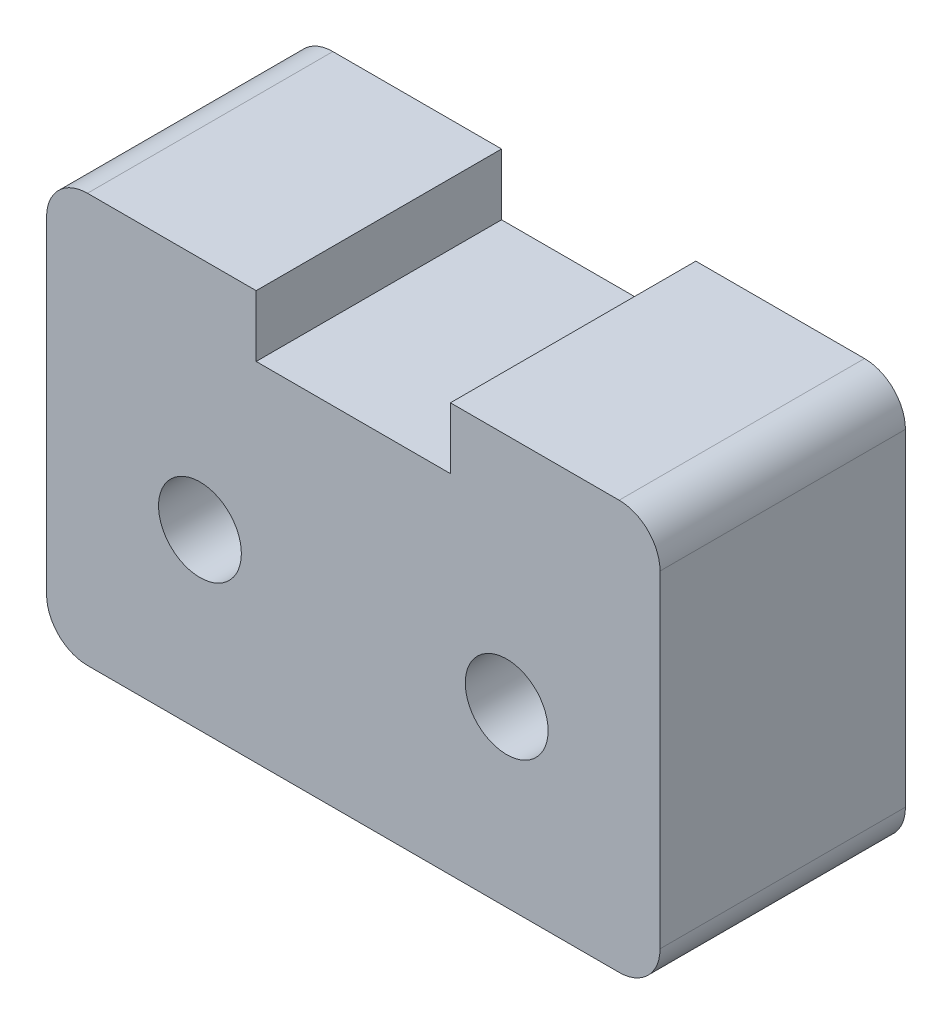
ISO-10303-21;
HEADER;
FILE_DESCRIPTION(('STEP AP214'),'2;1');
FILE_NAME('part.step','',(''),(''),'','','');
FILE_SCHEMA(('AUTOMOTIVE_DESIGN { 1 0 10303 214 1 1 1 1 }'));
ENDSEC;
DATA;
#1=APPLICATION_CONTEXT('core data for automotive mechanical design processes');
#2=APPLICATION_PROTOCOL_DEFINITION('international standard','automotive_design',2000,#1);
#3=PRODUCT_CONTEXT('',#1,'mechanical');
#4=PRODUCT('Part','Part','',(#3));
#5=PRODUCT_RELATED_PRODUCT_CATEGORY('part','',(#4));
#6=PRODUCT_DEFINITION_FORMATION('','',#4);
#7=PRODUCT_DEFINITION_CONTEXT('part definition',#1,'design');
#8=PRODUCT_DEFINITION('design','',#6,#7);
#9=PRODUCT_DEFINITION_SHAPE('','',#8);
#10=(LENGTH_UNIT() NAMED_UNIT(*) SI_UNIT(.MILLI.,.METRE.));
#11=(NAMED_UNIT(*) PLANE_ANGLE_UNIT() SI_UNIT($,.RADIAN.));
#12=(NAMED_UNIT(*) SI_UNIT($,.STERADIAN.) SOLID_ANGLE_UNIT());
#13=UNCERTAINTY_MEASURE_WITH_UNIT(LENGTH_MEASURE(1.E-05),#10,'distance_accuracy_value','');
#14=(GEOMETRIC_REPRESENTATION_CONTEXT(3) GLOBAL_UNCERTAINTY_ASSIGNED_CONTEXT((#13)) GLOBAL_UNIT_ASSIGNED_CONTEXT((#10,
#11,#12)) REPRESENTATION_CONTEXT('',''));
#15=CARTESIAN_POINT('',(0.,0.,0.));
#16=DIRECTION('',(0.,0.,1.));
#17=DIRECTION('',(1.,0.,0.));
#18=AXIS2_PLACEMENT_3D('',#15,#16,#17);
#19=CARTESIAN_POINT('',(-4.75,0.,12.));
#20=DIRECTION('',(-1.,0.,0.));
#21=DIRECTION('',(0.,0.,1.));
#22=AXIS2_PLACEMENT_3D('',#19,#20,#21);
#23=PLANE('',#22);
#24=DIRECTION('',(0.,1.,0.));
#25=VECTOR('',#24,1.);
#26=CARTESIAN_POINT('',(-4.75,0.,0.));
#27=LINE('',#26,#25);
#28=CARTESIAN_POINT('',(-4.75,0.,0.));
#29=VERTEX_POINT('',#28);
#30=CARTESIAN_POINT('',(-4.75,3.,0.));
#31=VERTEX_POINT('',#30);
#32=EDGE_CURVE('E150',#29,#31,#27,.T.);
#33=ORIENTED_EDGE('',*,*,#32,.T.);
#34=DIRECTION('',(0.,0.,-1.));
#35=VECTOR('',#34,1.);
#36=CARTESIAN_POINT('',(-4.75,3.,12.));
#37=LINE('',#36,#35);
#38=CARTESIAN_POINT('',(-4.75,3.,12.));
#39=VERTEX_POINT('',#38);
#40=EDGE_CURVE('E132',#39,#31,#37,.T.);
#41=ORIENTED_EDGE('',*,*,#40,.F.);
#42=DIRECTION('',(0.,1.,0.));
#43=VECTOR('',#42,1.);
#44=CARTESIAN_POINT('',(-4.75,0.,12.));
#45=LINE('',#44,#43);
#46=CARTESIAN_POINT('',(-4.75,0.,12.));
#47=VERTEX_POINT('',#46);
#48=EDGE_CURVE('E137',#47,#39,#45,.T.);
#49=ORIENTED_EDGE('',*,*,#48,.F.);
#50=DIRECTION('',(0.,0.,-1.));
#51=VECTOR('',#50,1.);
#52=CARTESIAN_POINT('',(-4.75,0.,12.));
#53=LINE('',#52,#51);
#54=EDGE_CURVE('E210',#47,#29,#53,.T.);
#55=ORIENTED_EDGE('',*,*,#54,.T.);
#56=EDGE_LOOP('',(#33,#41,#49,#55));
#57=FACE_BOUND('',#56,.T.);
#58=ADVANCED_FACE('F36',(#57),#23,.F.);
#59=CARTESIAN_POINT('',(-4.75,3.,12.));
#60=DIRECTION('',(0.,-1.,0.));
#61=DIRECTION('',(1.,0.,0.));
#62=AXIS2_PLACEMENT_3D('',#59,#60,#61);
#63=PLANE('',#62);
#64=DIRECTION('',(-1.,0.,0.));
#65=VECTOR('',#64,1.);
#66=CARTESIAN_POINT('',(-4.75,3.,0.));
#67=LINE('',#66,#65);
#68=CARTESIAN_POINT('',(-13.,3.,0.));
#69=VERTEX_POINT('',#68);
#70=EDGE_CURVE('E217',#31,#69,#67,.T.);
#71=ORIENTED_EDGE('',*,*,#70,.T.);
#72=DIRECTION('',(0.,0.,-1.));
#73=VECTOR('',#72,1.);
#74=CARTESIAN_POINT('',(-13.,3.,12.));
#75=LINE('',#74,#73);
#76=CARTESIAN_POINT('',(-13.,3.,12.));
#77=VERTEX_POINT('',#76);
#78=EDGE_CURVE('E11',#69,#77,#75,.F.);
#79=ORIENTED_EDGE('',*,*,#78,.T.);
#80=DIRECTION('',(-1.,0.,0.));
#81=VECTOR('',#80,1.);
#82=CARTESIAN_POINT('',(-4.75,3.,12.));
#83=LINE('',#82,#81);
#84=EDGE_CURVE('E127',#39,#77,#83,.T.);
#85=ORIENTED_EDGE('',*,*,#84,.F.);
#86=ORIENTED_EDGE('',*,*,#40,.T.);
#87=EDGE_LOOP('',(#71,#79,#85,#86));
#88=FACE_BOUND('',#87,.T.);
#89=ADVANCED_FACE('F130',(#88),#63,.F.);
#90=CARTESIAN_POINT('',(-15.,3.,12.));
#91=DIRECTION('',(1.,0.,0.));
#92=DIRECTION('',(0.,0.,-1.));
#93=AXIS2_PLACEMENT_3D('',#90,#91,#92);
#94=PLANE('',#93);
#95=DIRECTION('',(0.,-1.,0.));
#96=VECTOR('',#95,1.);
#97=CARTESIAN_POINT('',(-15.,3.,0.));
#98=LINE('',#97,#96);
#99=CARTESIAN_POINT('',(-15.,0.999999999999998,0.));
#100=VERTEX_POINT('',#99);
#101=CARTESIAN_POINT('',(-15.,-15.,0.));
#102=VERTEX_POINT('',#101);
#103=EDGE_CURVE('E220',#100,#102,#98,.T.);
#104=ORIENTED_EDGE('',*,*,#103,.T.);
#105=DIRECTION('',(0.,0.,-1.));
#106=VECTOR('',#105,1.);
#107=CARTESIAN_POINT('',(-15.,-15.,12.));
#108=LINE('',#107,#106);
#109=CARTESIAN_POINT('',(-15.,-15.,12.));
#110=VERTEX_POINT('',#109);
#111=EDGE_CURVE('E59',#102,#110,#108,.F.);
#112=ORIENTED_EDGE('',*,*,#111,.T.);
#113=DIRECTION('',(0.,-1.,0.));
#114=VECTOR('',#113,1.);
#115=CARTESIAN_POINT('',(-15.,3.,12.));
#116=LINE('',#115,#114);
#117=CARTESIAN_POINT('',(-15.,0.999999999999998,12.));
#118=VERTEX_POINT('',#117);
#119=EDGE_CURVE('E136',#118,#110,#116,.T.);
#120=ORIENTED_EDGE('',*,*,#119,.F.);
#121=DIRECTION('',(0.,0.,-1.));
#122=VECTOR('',#121,1.);
#123=CARTESIAN_POINT('',(-15.,0.999999999999998,12.));
#124=LINE('',#123,#122);
#125=EDGE_CURVE('E183',#118,#100,#124,.T.);
#126=ORIENTED_EDGE('',*,*,#125,.T.);
#127=EDGE_LOOP('',(#104,#112,#120,#126));
#128=FACE_BOUND('',#127,.T.);
#129=ADVANCED_FACE('F264',(#128),#94,.F.);
#130=CARTESIAN_POINT('',(-15.,-17.,12.));
#131=DIRECTION('',(0.,1.,0.));
#132=DIRECTION('',(0.,0.,1.));
#133=AXIS2_PLACEMENT_3D('',#130,#131,#132);
#134=PLANE('',#133);
#135=DIRECTION('',(1.,0.,0.));
#136=VECTOR('',#135,1.);
#137=CARTESIAN_POINT('',(-15.,-17.,0.));
#138=LINE('',#137,#136);
#139=CARTESIAN_POINT('',(-13.,-17.,0.));
#140=VERTEX_POINT('',#139);
#141=CARTESIAN_POINT('',(13.,-17.,0.));
#142=VERTEX_POINT('',#141);
#143=EDGE_CURVE('E205',#140,#142,#138,.T.);
#144=ORIENTED_EDGE('',*,*,#143,.T.);
#145=DIRECTION('',(0.,0.,-1.));
#146=VECTOR('',#145,1.);
#147=CARTESIAN_POINT('',(13.,-17.,12.));
#148=LINE('',#147,#146);
#149=CARTESIAN_POINT('',(13.,-17.,12.));
#150=VERTEX_POINT('',#149);
#151=EDGE_CURVE('E174',#142,#150,#148,.F.);
#152=ORIENTED_EDGE('',*,*,#151,.T.);
#153=DIRECTION('',(1.,0.,0.));
#154=VECTOR('',#153,1.);
#155=CARTESIAN_POINT('',(-15.,-17.,12.));
#156=LINE('',#155,#154);
#157=CARTESIAN_POINT('',(-13.,-17.,12.));
#158=VERTEX_POINT('',#157);
#159=EDGE_CURVE('E241',#158,#150,#156,.T.);
#160=ORIENTED_EDGE('',*,*,#159,.F.);
#161=DIRECTION('',(0.,0.,-1.));
#162=VECTOR('',#161,1.);
#163=CARTESIAN_POINT('',(-13.,-17.,12.));
#164=LINE('',#163,#162);
#165=EDGE_CURVE('E171',#158,#140,#164,.T.);
#166=ORIENTED_EDGE('',*,*,#165,.T.);
#167=EDGE_LOOP('',(#144,#152,#160,#166));
#168=FACE_BOUND('',#167,.T.);
#169=ADVANCED_FACE('F232',(#168),#134,.F.);
#170=CARTESIAN_POINT('',(15.,3.,12.));
#171=DIRECTION('',(-1.,0.,0.));
#172=DIRECTION('',(0.,0.,1.));
#173=AXIS2_PLACEMENT_3D('',#170,#171,#172);
#174=PLANE('',#173);
#175=DIRECTION('',(0.,1.,0.));
#176=VECTOR('',#175,1.);
#177=CARTESIAN_POINT('',(15.,3.,12.));
#178=LINE('',#177,#176);
#179=CARTESIAN_POINT('',(15.,-15.,12.));
#180=VERTEX_POINT('',#179);
#181=CARTESIAN_POINT('',(15.,0.999999999999998,12.));
#182=VERTEX_POINT('',#181);
#183=EDGE_CURVE('E240',#180,#182,#178,.T.);
#184=ORIENTED_EDGE('',*,*,#183,.F.);
#185=DIRECTION('',(0.,0.,-1.));
#186=VECTOR('',#185,1.);
#187=CARTESIAN_POINT('',(15.,-15.,12.));
#188=LINE('',#187,#186);
#189=CARTESIAN_POINT('',(15.,-15.,0.));
#190=VERTEX_POINT('',#189);
#191=EDGE_CURVE('E154',#180,#190,#188,.T.);
#192=ORIENTED_EDGE('',*,*,#191,.T.);
#193=DIRECTION('',(0.,1.,0.));
#194=VECTOR('',#193,1.);
#195=CARTESIAN_POINT('',(15.,3.,0.));
#196=LINE('',#195,#194);
#197=CARTESIAN_POINT('',(15.,0.999999999999998,0.));
#198=VERTEX_POINT('',#197);
#199=EDGE_CURVE('E202',#190,#198,#196,.T.);
#200=ORIENTED_EDGE('',*,*,#199,.T.);
#201=DIRECTION('',(0.,0.,-1.));
#202=VECTOR('',#201,1.);
#203=CARTESIAN_POINT('',(15.,0.999999999999998,12.));
#204=LINE('',#203,#202);
#205=EDGE_CURVE('E151',#198,#182,#204,.F.);
#206=ORIENTED_EDGE('',*,*,#205,.T.);
#207=EDGE_LOOP('',(#184,#192,#200,#206));
#208=FACE_BOUND('',#207,.T.);
#209=ADVANCED_FACE('F243',(#208),#174,.F.);
#210=CARTESIAN_POINT('',(4.75,3.,12.));
#211=DIRECTION('',(0.,-1.,0.));
#212=DIRECTION('',(1.,0.,0.));
#213=AXIS2_PLACEMENT_3D('',#210,#211,#212);
#214=PLANE('',#213);
#215=DIRECTION('',(-1.,0.,0.));
#216=VECTOR('',#215,1.);
#217=CARTESIAN_POINT('',(4.75,3.,12.));
#218=LINE('',#217,#216);
#219=CARTESIAN_POINT('',(13.,3.,12.));
#220=VERTEX_POINT('',#219);
#221=CARTESIAN_POINT('',(4.75,3.,12.));
#222=VERTEX_POINT('',#221);
#223=EDGE_CURVE('E193',#220,#222,#218,.T.);
#224=ORIENTED_EDGE('',*,*,#223,.F.);
#225=DIRECTION('',(0.,0.,-1.));
#226=VECTOR('',#225,1.);
#227=CARTESIAN_POINT('',(13.,3.,12.));
#228=LINE('',#227,#226);
#229=CARTESIAN_POINT('',(13.,3.,0.));
#230=VERTEX_POINT('',#229);
#231=EDGE_CURVE('E44',#220,#230,#228,.T.);
#232=ORIENTED_EDGE('',*,*,#231,.T.);
#233=DIRECTION('',(-1.,0.,0.));
#234=VECTOR('',#233,1.);
#235=CARTESIAN_POINT('',(4.75,3.,0.));
#236=LINE('',#235,#234);
#237=CARTESIAN_POINT('',(4.75,3.,0.));
#238=VERTEX_POINT('',#237);
#239=EDGE_CURVE('E192',#230,#238,#236,.T.);
#240=ORIENTED_EDGE('',*,*,#239,.T.);
#241=DIRECTION('',(0.,0.,-1.));
#242=VECTOR('',#241,1.);
#243=CARTESIAN_POINT('',(4.75,3.,12.));
#244=LINE('',#243,#242);
#245=EDGE_CURVE('E152',#222,#238,#244,.T.);
#246=ORIENTED_EDGE('',*,*,#245,.F.);
#247=EDGE_LOOP('',(#224,#232,#240,#246));
#248=FACE_BOUND('',#247,.T.);
#249=ADVANCED_FACE('F190',(#248),#214,.F.);
#250=CARTESIAN_POINT('',(4.75,0.,12.));
#251=DIRECTION('',(1.,0.,0.));
#252=DIRECTION('',(0.,0.,-1.));
#253=AXIS2_PLACEMENT_3D('',#250,#251,#252);
#254=PLANE('',#253);
#255=DIRECTION('',(0.,-1.,0.));
#256=VECTOR('',#255,1.);
#257=CARTESIAN_POINT('',(4.75,0.,0.));
#258=LINE('',#257,#256);
#259=CARTESIAN_POINT('',(4.75,0.,0.));
#260=VERTEX_POINT('',#259);
#261=EDGE_CURVE('E201',#238,#260,#258,.T.);
#262=ORIENTED_EDGE('',*,*,#261,.T.);
#263=DIRECTION('',(0.,0.,-1.));
#264=VECTOR('',#263,1.);
#265=CARTESIAN_POINT('',(4.75,0.,12.));
#266=LINE('',#265,#264);
#267=CARTESIAN_POINT('',(4.75,0.,12.));
#268=VERTEX_POINT('',#267);
#269=EDGE_CURVE('E157',#268,#260,#266,.T.);
#270=ORIENTED_EDGE('',*,*,#269,.F.);
#271=DIRECTION('',(0.,-1.,0.));
#272=VECTOR('',#271,1.);
#273=CARTESIAN_POINT('',(4.75,0.,12.));
#274=LINE('',#273,#272);
#275=EDGE_CURVE('E246',#222,#268,#274,.T.);
#276=ORIENTED_EDGE('',*,*,#275,.F.);
#277=ORIENTED_EDGE('',*,*,#245,.T.);
#278=EDGE_LOOP('',(#262,#270,#276,#277));
#279=FACE_BOUND('',#278,.T.);
#280=ADVANCED_FACE('F250',(#279),#254,.F.);
#281=CARTESIAN_POINT('',(4.75,0.,12.));
#282=DIRECTION('',(0.,-1.,0.));
#283=DIRECTION('',(0.,0.,-1.));
#284=AXIS2_PLACEMENT_3D('',#281,#282,#283);
#285=PLANE('',#284);
#286=DIRECTION('',(-1.,0.,0.));
#287=VECTOR('',#286,1.);
#288=CARTESIAN_POINT('',(4.75,0.,0.));
#289=LINE('',#288,#287);
#290=EDGE_CURVE('E147',#260,#29,#289,.T.);
#291=ORIENTED_EDGE('',*,*,#290,.T.);
#292=ORIENTED_EDGE('',*,*,#54,.F.);
#293=DIRECTION('',(-1.,0.,0.));
#294=VECTOR('',#293,1.);
#295=CARTESIAN_POINT('',(4.75,0.,12.));
#296=LINE('',#295,#294);
#297=EDGE_CURVE('E143',#268,#47,#296,.T.);
#298=ORIENTED_EDGE('',*,*,#297,.F.);
#299=ORIENTED_EDGE('',*,*,#269,.T.);
#300=EDGE_LOOP('',(#291,#292,#298,#299));
#301=FACE_BOUND('',#300,.T.);
#302=ADVANCED_FACE('F214',(#301),#285,.F.);
#303=CARTESIAN_POINT('',(0.,0.,12.));
#304=DIRECTION('',(0.,0.,1.));
#305=DIRECTION('',(1.,0.,0.));
#306=AXIS2_PLACEMENT_3D('',#303,#304,#305);
#307=PLANE('',#306);
#308=CARTESIAN_POINT('',(-7.5,-8.5,12.));
#309=DIRECTION('',(0.,0.,1.));
#310=DIRECTION('',(1.,0.,0.));
#311=AXIS2_PLACEMENT_3D('',#308,#309,#310);
#312=CIRCLE('',#311,2.025);
#313=CARTESIAN_POINT('',(-5.475,-8.5,12.));
#314=VERTEX_POINT('',#313);
#315=EDGE_CURVE('E218',#314,#314,#312,.T.);
#316=ORIENTED_EDGE('',*,*,#315,.F.);
#317=EDGE_LOOP('',(#316));
#318=FACE_BOUND('',#317,.T.);
#319=CARTESIAN_POINT('',(7.5,-8.5,12.));
#320=DIRECTION('',(0.,0.,1.));
#321=DIRECTION('',(1.,0.,0.));
#322=AXIS2_PLACEMENT_3D('',#319,#320,#321);
#323=CIRCLE('',#322,2.025);
#324=CARTESIAN_POINT('',(9.525,-8.5,12.));
#325=VERTEX_POINT('',#324);
#326=EDGE_CURVE('E223',#325,#325,#323,.T.);
#327=ORIENTED_EDGE('',*,*,#326,.F.);
#328=EDGE_LOOP('',(#327));
#329=FACE_BOUND('',#328,.T.);
#330=ORIENTED_EDGE('',*,*,#159,.T.);
#331=CARTESIAN_POINT('',(13.,-15.,12.));
#332=DIRECTION('',(0.,0.,1.));
#333=DIRECTION('',(1.,0.,0.));
#334=AXIS2_PLACEMENT_3D('',#331,#332,#333);
#335=CIRCLE('',#334,2.);
#336=EDGE_CURVE('E181',#150,#180,#335,.T.);
#337=ORIENTED_EDGE('',*,*,#336,.T.);
#338=ORIENTED_EDGE('',*,*,#183,.T.);
#339=CARTESIAN_POINT('',(13.,0.999999999999998,12.));
#340=DIRECTION('',(0.,0.,1.));
#341=DIRECTION('',(1.,0.,0.));
#342=AXIS2_PLACEMENT_3D('',#339,#340,#341);
#343=CIRCLE('',#342,2.);
#344=EDGE_CURVE('E51',#182,#220,#343,.T.);
#345=ORIENTED_EDGE('',*,*,#344,.T.);
#346=ORIENTED_EDGE('',*,*,#223,.T.);
#347=ORIENTED_EDGE('',*,*,#275,.T.);
#348=ORIENTED_EDGE('',*,*,#297,.T.);
#349=ORIENTED_EDGE('',*,*,#48,.T.);
#350=ORIENTED_EDGE('',*,*,#84,.T.);
#351=CARTESIAN_POINT('',(-13.,0.999999999999998,12.));
#352=DIRECTION('',(0.,0.,1.));
#353=DIRECTION('',(1.,0.,0.));
#354=AXIS2_PLACEMENT_3D('',#351,#352,#353);
#355=CIRCLE('',#354,2.);
#356=EDGE_CURVE('E176',#77,#118,#355,.T.);
#357=ORIENTED_EDGE('',*,*,#356,.T.);
#358=ORIENTED_EDGE('',*,*,#119,.T.);
#359=CARTESIAN_POINT('',(-13.,-15.,12.));
#360=DIRECTION('',(0.,0.,1.));
#361=DIRECTION('',(1.,0.,0.));
#362=AXIS2_PLACEMENT_3D('',#359,#360,#361);
#363=CIRCLE('',#362,2.);
#364=EDGE_CURVE('E179',#110,#158,#363,.T.);
#365=ORIENTED_EDGE('',*,*,#364,.T.);
#366=EDGE_LOOP('',(#330,#337,#338,#345,#346,#347,#348,#349,#350,#357,#358,#365));
#367=FACE_BOUND('',#366,.T.);
#368=ADVANCED_FACE('F141',(#318,#329,#367),#307,.T.);
#369=CARTESIAN_POINT('',(0.,0.,0.));
#370=DIRECTION('',(0.,0.,1.));
#371=DIRECTION('',(1.,0.,0.));
#372=AXIS2_PLACEMENT_3D('',#369,#370,#371);
#373=PLANE('',#372);
#374=CARTESIAN_POINT('',(-7.5,-8.5,0.));
#375=DIRECTION('',(0.,0.,1.));
#376=DIRECTION('',(1.,0.,0.));
#377=AXIS2_PLACEMENT_3D('',#374,#375,#376);
#378=CIRCLE('',#377,2.025);
#379=CARTESIAN_POINT('',(-5.475,-8.5,0.));
#380=VERTEX_POINT('',#379);
#381=EDGE_CURVE('E292',#380,#380,#378,.T.);
#382=ORIENTED_EDGE('',*,*,#381,.T.);
#383=EDGE_LOOP('',(#382));
#384=FACE_BOUND('',#383,.T.);
#385=CARTESIAN_POINT('',(7.5,-8.5,0.));
#386=DIRECTION('',(0.,0.,1.));
#387=DIRECTION('',(1.,0.,0.));
#388=AXIS2_PLACEMENT_3D('',#385,#386,#387);
#389=CIRCLE('',#388,2.025);
#390=CARTESIAN_POINT('',(9.525,-8.5,0.));
#391=VERTEX_POINT('',#390);
#392=EDGE_CURVE('E293',#391,#391,#389,.T.);
#393=ORIENTED_EDGE('',*,*,#392,.T.);
#394=EDGE_LOOP('',(#393));
#395=FACE_BOUND('',#394,.T.);
#396=ORIENTED_EDGE('',*,*,#199,.F.);
#397=CARTESIAN_POINT('',(13.,-15.,0.));
#398=DIRECTION('',(0.,0.,1.));
#399=DIRECTION('',(1.,0.,0.));
#400=AXIS2_PLACEMENT_3D('',#397,#398,#399);
#401=CIRCLE('',#400,2.);
#402=EDGE_CURVE('E169',#190,#142,#401,.F.);
#403=ORIENTED_EDGE('',*,*,#402,.T.);
#404=ORIENTED_EDGE('',*,*,#143,.F.);
#405=CARTESIAN_POINT('',(-13.,-15.,0.));
#406=DIRECTION('',(0.,0.,1.));
#407=DIRECTION('',(1.,0.,0.));
#408=AXIS2_PLACEMENT_3D('',#405,#406,#407);
#409=CIRCLE('',#408,2.);
#410=EDGE_CURVE('E167',#140,#102,#409,.F.);
#411=ORIENTED_EDGE('',*,*,#410,.T.);
#412=ORIENTED_EDGE('',*,*,#103,.F.);
#413=CARTESIAN_POINT('',(-13.,0.999999999999998,0.));
#414=DIRECTION('',(0.,0.,1.));
#415=DIRECTION('',(1.,0.,0.));
#416=AXIS2_PLACEMENT_3D('',#413,#414,#415);
#417=CIRCLE('',#416,2.);
#418=EDGE_CURVE('E163',#100,#69,#417,.F.);
#419=ORIENTED_EDGE('',*,*,#418,.T.);
#420=ORIENTED_EDGE('',*,*,#70,.F.);
#421=ORIENTED_EDGE('',*,*,#32,.F.);
#422=ORIENTED_EDGE('',*,*,#290,.F.);
#423=ORIENTED_EDGE('',*,*,#261,.F.);
#424=ORIENTED_EDGE('',*,*,#239,.F.);
#425=CARTESIAN_POINT('',(13.,0.999999999999998,0.));
#426=DIRECTION('',(0.,0.,1.));
#427=DIRECTION('',(1.,0.,0.));
#428=AXIS2_PLACEMENT_3D('',#425,#426,#427);
#429=CIRCLE('',#428,2.);
#430=EDGE_CURVE('E165',#230,#198,#429,.F.);
#431=ORIENTED_EDGE('',*,*,#430,.T.);
#432=EDGE_LOOP('',(#396,#403,#404,#411,#412,#419,#420,#421,#422,#423,#424,#431));
#433=FACE_BOUND('',#432,.T.);
#434=ADVANCED_FACE('F198',(#384,#395,#433),#373,.F.);
#435=CARTESIAN_POINT('',(13.,-15.,12.));
#436=DIRECTION('',(0.,0.,-1.));
#437=DIRECTION('',(-1.,0.,0.));
#438=AXIS2_PLACEMENT_3D('',#435,#436,#437);
#439=CYLINDRICAL_SURFACE('',#438,2.);
#440=ORIENTED_EDGE('',*,*,#336,.F.);
#441=ORIENTED_EDGE('',*,*,#151,.F.);
#442=ORIENTED_EDGE('',*,*,#402,.F.);
#443=ORIENTED_EDGE('',*,*,#191,.F.);
#444=EDGE_LOOP('',(#440,#441,#442,#443));
#445=FACE_BOUND('',#444,.T.);
#446=ADVANCED_FACE('F237',(#445),#439,.T.);
#447=CARTESIAN_POINT('',(-13.,-15.,12.));
#448=DIRECTION('',(0.,0.,-1.));
#449=DIRECTION('',(-1.,0.,0.));
#450=AXIS2_PLACEMENT_3D('',#447,#448,#449);
#451=CYLINDRICAL_SURFACE('',#450,2.);
#452=ORIENTED_EDGE('',*,*,#364,.F.);
#453=ORIENTED_EDGE('',*,*,#111,.F.);
#454=ORIENTED_EDGE('',*,*,#410,.F.);
#455=ORIENTED_EDGE('',*,*,#165,.F.);
#456=EDGE_LOOP('',(#452,#453,#454,#455));
#457=FACE_BOUND('',#456,.T.);
#458=ADVANCED_FACE('F270',(#457),#451,.T.);
#459=CARTESIAN_POINT('',(13.,0.999999999999998,12.));
#460=DIRECTION('',(0.,0.,-1.));
#461=DIRECTION('',(-1.,0.,0.));
#462=AXIS2_PLACEMENT_3D('',#459,#460,#461);
#463=CYLINDRICAL_SURFACE('',#462,2.);
#464=ORIENTED_EDGE('',*,*,#344,.F.);
#465=ORIENTED_EDGE('',*,*,#205,.F.);
#466=ORIENTED_EDGE('',*,*,#430,.F.);
#467=ORIENTED_EDGE('',*,*,#231,.F.);
#468=EDGE_LOOP('',(#464,#465,#466,#467));
#469=FACE_BOUND('',#468,.T.);
#470=ADVANCED_FACE('F272',(#469),#463,.T.);
#471=CARTESIAN_POINT('',(-13.,0.999999999999998,12.));
#472=DIRECTION('',(0.,0.,-1.));
#473=DIRECTION('',(-1.,0.,0.));
#474=AXIS2_PLACEMENT_3D('',#471,#472,#473);
#475=CYLINDRICAL_SURFACE('',#474,2.);
#476=ORIENTED_EDGE('',*,*,#356,.F.);
#477=ORIENTED_EDGE('',*,*,#78,.F.);
#478=ORIENTED_EDGE('',*,*,#418,.F.);
#479=ORIENTED_EDGE('',*,*,#125,.F.);
#480=EDGE_LOOP('',(#476,#477,#478,#479));
#481=FACE_BOUND('',#480,.T.);
#482=ADVANCED_FACE('F38',(#481),#475,.T.);
#483=CARTESIAN_POINT('',(7.5,-8.5,0.));
#484=DIRECTION('',(0.,0.,1.));
#485=DIRECTION('',(1.,0.,0.));
#486=AXIS2_PLACEMENT_3D('',#483,#484,#485);
#487=CYLINDRICAL_SURFACE('',#486,2.025);
#488=ORIENTED_EDGE('',*,*,#326,.T.);
#489=EDGE_LOOP('',(#488));
#490=FACE_BOUND('',#489,.T.);
#491=ORIENTED_EDGE('',*,*,#392,.F.);
#492=EDGE_LOOP('',(#491));
#493=FACE_BOUND('',#492,.T.);
#494=ADVANCED_FACE('F278',(#490,#493),#487,.F.);
#495=CARTESIAN_POINT('',(-7.5,-8.5,0.));
#496=DIRECTION('',(0.,0.,1.));
#497=DIRECTION('',(1.,0.,0.));
#498=AXIS2_PLACEMENT_3D('',#495,#496,#497);
#499=CYLINDRICAL_SURFACE('',#498,2.025);
#500=ORIENTED_EDGE('',*,*,#315,.T.);
#501=EDGE_LOOP('',(#500));
#502=FACE_BOUND('',#501,.T.);
#503=ORIENTED_EDGE('',*,*,#381,.F.);
#504=EDGE_LOOP('',(#503));
#505=FACE_BOUND('',#504,.T.);
#506=ADVANCED_FACE('F283',(#502,#505),#499,.F.);
#507=CLOSED_SHELL('',(#58,#89,#129,#169,#209,#249,#280,#302,#368,#434,#446,#458,#470,#482,#494,#506));
#508=MANIFOLD_SOLID_BREP('B2',#507);
#509=ADVANCED_BREP_SHAPE_REPRESENTATION('',(#18,#508),#14);
#510=SHAPE_DEFINITION_REPRESENTATION(#9,#509);
ENDSEC;
END-ISO-10303-21;
